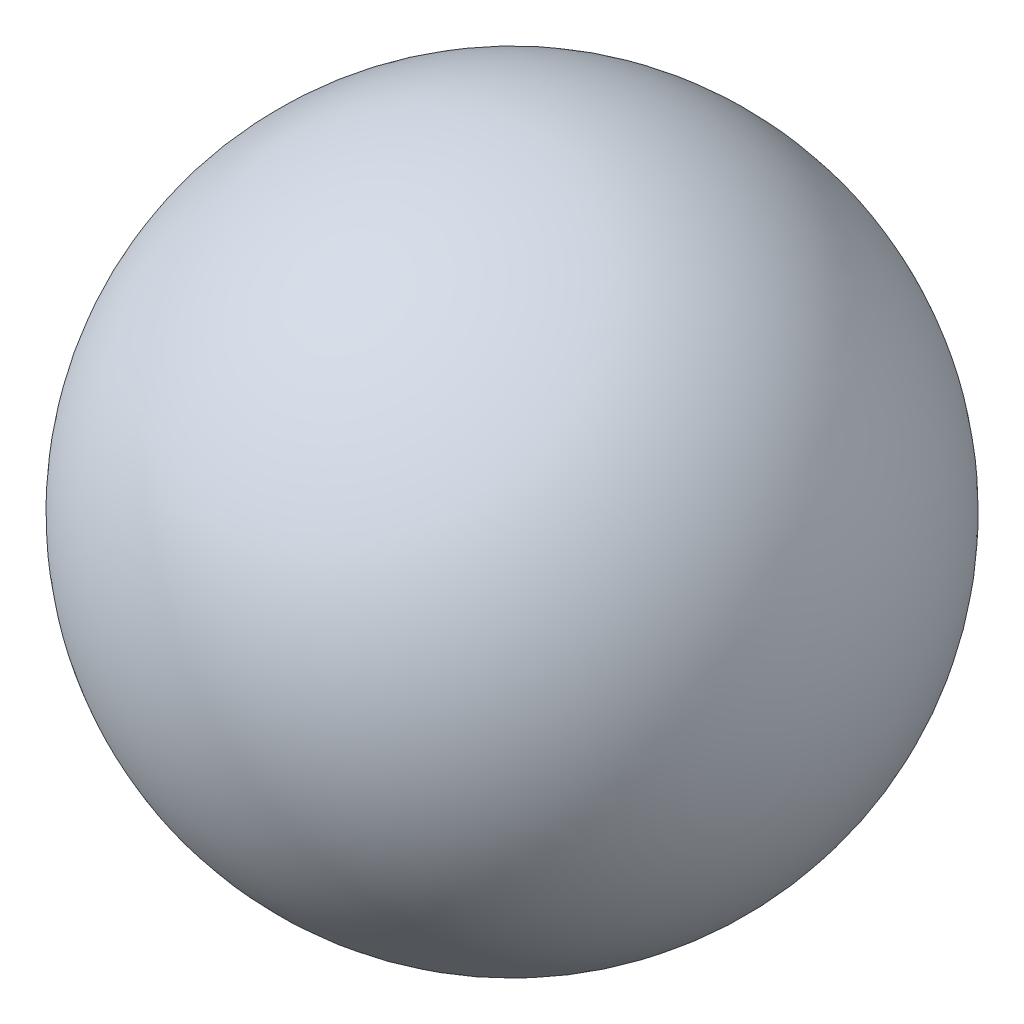
ISO-10303-21;
HEADER;
FILE_DESCRIPTION(('STEP AP214'),'2;1');
FILE_NAME('part.step','',(''),(''),'','','');
FILE_SCHEMA(('AUTOMOTIVE_DESIGN { 1 0 10303 214 1 1 1 1 }'));
ENDSEC;
DATA;
#1=APPLICATION_CONTEXT('core data for automotive mechanical design processes');
#2=APPLICATION_PROTOCOL_DEFINITION('international standard','automotive_design',2000,#1);
#3=PRODUCT_CONTEXT('',#1,'mechanical');
#4=PRODUCT('Part','Part','',(#3));
#5=PRODUCT_RELATED_PRODUCT_CATEGORY('part','',(#4));
#6=PRODUCT_DEFINITION_FORMATION('','',#4);
#7=PRODUCT_DEFINITION_CONTEXT('part definition',#1,'design');
#8=PRODUCT_DEFINITION('design','',#6,#7);
#9=PRODUCT_DEFINITION_SHAPE('','',#8);
#10=(LENGTH_UNIT() NAMED_UNIT(*) SI_UNIT(.MILLI.,.METRE.));
#11=(NAMED_UNIT(*) PLANE_ANGLE_UNIT() SI_UNIT($,.RADIAN.));
#12=(NAMED_UNIT(*) SI_UNIT($,.STERADIAN.) SOLID_ANGLE_UNIT());
#13=UNCERTAINTY_MEASURE_WITH_UNIT(LENGTH_MEASURE(1.E-05),#10,'distance_accuracy_value','');
#14=(GEOMETRIC_REPRESENTATION_CONTEXT(3) GLOBAL_UNCERTAINTY_ASSIGNED_CONTEXT((#13)) GLOBAL_UNIT_ASSIGNED_CONTEXT((#10,
#11,#12)) REPRESENTATION_CONTEXT('',''));
#15=CARTESIAN_POINT('',(0.,0.,0.));
#16=DIRECTION('',(0.,0.,1.));
#17=DIRECTION('',(1.,0.,0.));
#18=AXIS2_PLACEMENT_3D('',#15,#16,#17);
#19=CARTESIAN_POINT('',(0.,0.,-304.8));
#20=DIRECTION('',(0.,0.,1.));
#21=DIRECTION('',(-1.,0.,0.));
#22=AXIS2_PLACEMENT_3D('',#19,#20,#21);
#23=SPHERICAL_SURFACE('',#22,304.8);
#24=CARTESIAN_POINT('',(0.,0.,0.));
#25=VERTEX_POINT('',#24);
#26=VERTEX_LOOP('',#25);
#27=FACE_BOUND('',#26,.T.);
#28=ADVANCED_FACE('F29',(#27),#23,.T.);
#29=CLOSED_SHELL('',(#28));
#30=MANIFOLD_SOLID_BREP('B2',#29);
#31=ADVANCED_BREP_SHAPE_REPRESENTATION('',(#18,#30),#14);
#32=SHAPE_DEFINITION_REPRESENTATION(#9,#31);
ENDSEC;
END-ISO-10303-21;
